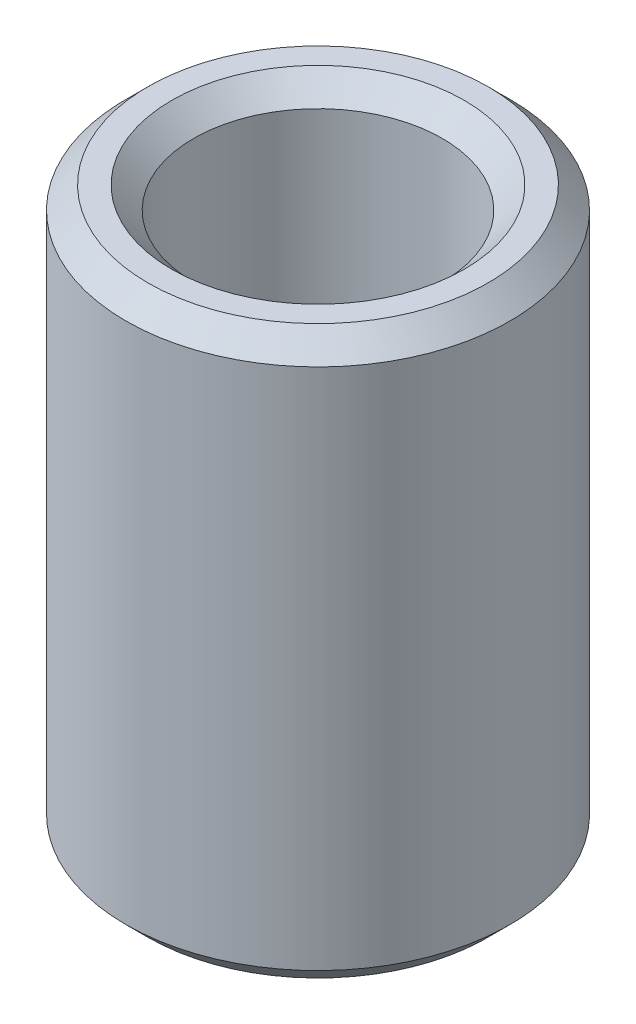
ISO-10303-21;
HEADER;
FILE_DESCRIPTION(('STEP AP214'),'2;1');
FILE_NAME('part.step','',(''),(''),'','','');
FILE_SCHEMA(('AUTOMOTIVE_DESIGN { 1 0 10303 214 1 1 1 1 }'));
ENDSEC;
DATA;
#1=APPLICATION_CONTEXT('core data for automotive mechanical design processes');
#2=APPLICATION_PROTOCOL_DEFINITION('international standard','automotive_design',2000,#1);
#3=PRODUCT_CONTEXT('',#1,'mechanical');
#4=PRODUCT('Part','Part','',(#3));
#5=PRODUCT_RELATED_PRODUCT_CATEGORY('part','',(#4));
#6=PRODUCT_DEFINITION_FORMATION('','',#4);
#7=PRODUCT_DEFINITION_CONTEXT('part definition',#1,'design');
#8=PRODUCT_DEFINITION('design','',#6,#7);
#9=PRODUCT_DEFINITION_SHAPE('','',#8);
#10=(LENGTH_UNIT() NAMED_UNIT(*) SI_UNIT(.MILLI.,.METRE.));
#11=(NAMED_UNIT(*) PLANE_ANGLE_UNIT() SI_UNIT($,.RADIAN.));
#12=(NAMED_UNIT(*) SI_UNIT($,.STERADIAN.) SOLID_ANGLE_UNIT());
#13=UNCERTAINTY_MEASURE_WITH_UNIT(LENGTH_MEASURE(1.E-05),#10,'distance_accuracy_value','');
#14=(GEOMETRIC_REPRESENTATION_CONTEXT(3) GLOBAL_UNCERTAINTY_ASSIGNED_CONTEXT((#13)) GLOBAL_UNIT_ASSIGNED_CONTEXT((#10,
#11,#12)) REPRESENTATION_CONTEXT('',''));
#15=CARTESIAN_POINT('',(0.,0.,0.));
#16=DIRECTION('',(0.,0.,1.));
#17=DIRECTION('',(1.,0.,0.));
#18=AXIS2_PLACEMENT_3D('',#15,#16,#17);
#19=CARTESIAN_POINT('',(0.,22.1363297240755,0.));
#20=DIRECTION('',(0.,-1.,0.));
#21=DIRECTION('',(0.,0.,-1.));
#22=AXIS2_PLACEMENT_3D('',#19,#20,#21);
#23=CYLINDRICAL_SURFACE('',#22,7.5);
#24=CARTESIAN_POINT('',(0.,0.85842697095161,0.));
#25=DIRECTION('',(0.,1.,0.));
#26=DIRECTION('',(0.,0.,1.));
#27=AXIS2_PLACEMENT_3D('',#24,#25,#26);
#28=CIRCLE('',#27,7.5);
#29=CARTESIAN_POINT('',(0.,0.85842697095161,7.5));
#30=VERTEX_POINT('',#29);
#31=EDGE_CURVE('E10',#30,#30,#28,.T.);
#32=ORIENTED_EDGE('',*,*,#31,.T.);
#33=EDGE_LOOP('',(#32));
#34=FACE_BOUND('',#33,.T.);
#35=CARTESIAN_POINT('',(0.,21.2779027531239,0.));
#36=DIRECTION('',(0.,1.,0.));
#37=DIRECTION('',(0.,0.,1.));
#38=AXIS2_PLACEMENT_3D('',#35,#36,#37);
#39=CIRCLE('',#38,7.5);
#40=CARTESIAN_POINT('',(0.,21.2779027531239,7.5));
#41=VERTEX_POINT('',#40);
#42=EDGE_CURVE('E50',#41,#41,#39,.F.);
#43=ORIENTED_EDGE('',*,*,#42,.T.);
#44=EDGE_LOOP('',(#43));
#45=FACE_BOUND('',#44,.T.);
#46=ADVANCED_FACE('F39',(#34,#45),#23,.T.);
#47=CARTESIAN_POINT('',(0.,22.1363297240755,0.));
#48=DIRECTION('',(0.,1.,0.));
#49=DIRECTION('',(0.,0.,1.));
#50=AXIS2_PLACEMENT_3D('',#47,#48,#49);
#51=PLANE('',#50);
#52=CARTESIAN_POINT('',(0.,22.1363297240755,0.));
#53=DIRECTION('',(0.,1.,0.));
#54=DIRECTION('',(0.,0.,1.));
#55=AXIS2_PLACEMENT_3D('',#52,#53,#54);
#56=CIRCLE('',#55,5.71524477503411);
#57=CARTESIAN_POINT('',(0.,22.1363297240755,5.71524477503411));
#58=VERTEX_POINT('',#57);
#59=EDGE_CURVE('E58',#58,#58,#56,.F.);
#60=ORIENTED_EDGE('',*,*,#59,.T.);
#61=EDGE_LOOP('',(#60));
#62=FACE_BOUND('',#61,.T.);
#63=CARTESIAN_POINT('',(0.,22.1363297240755,0.));
#64=DIRECTION('',(0.,1.,0.));
#65=DIRECTION('',(0.,0.,1.));
#66=AXIS2_PLACEMENT_3D('',#63,#64,#65);
#67=CIRCLE('',#66,6.64157302904839);
#68=CARTESIAN_POINT('',(0.,22.1363297240755,6.64157302904839));
#69=VERTEX_POINT('',#68);
#70=EDGE_CURVE('E61',#69,#69,#67,.T.);
#71=ORIENTED_EDGE('',*,*,#70,.T.);
#72=EDGE_LOOP('',(#71));
#73=FACE_BOUND('',#72,.T.);
#74=ADVANCED_FACE('F88',(#62,#73),#51,.T.);
#75=CARTESIAN_POINT('',(0.,0.,0.));
#76=DIRECTION('',(0.,1.,0.));
#77=DIRECTION('',(0.,0.,1.));
#78=AXIS2_PLACEMENT_3D('',#75,#76,#77);
#79=PLANE('',#78);
#80=CARTESIAN_POINT('',(0.,0.,0.));
#81=DIRECTION('',(0.,1.,0.));
#82=DIRECTION('',(0.,0.,1.));
#83=AXIS2_PLACEMENT_3D('',#80,#81,#82);
#84=CIRCLE('',#83,5.7152447750341);
#85=CARTESIAN_POINT('',(0.,0.,5.7152447750341));
#86=VERTEX_POINT('',#85);
#87=EDGE_CURVE('E51',#86,#86,#84,.T.);
#88=ORIENTED_EDGE('',*,*,#87,.T.);
#89=EDGE_LOOP('',(#88));
#90=FACE_BOUND('',#89,.T.);
#91=CARTESIAN_POINT('',(0.,0.,0.));
#92=DIRECTION('',(0.,1.,0.));
#93=DIRECTION('',(0.,0.,1.));
#94=AXIS2_PLACEMENT_3D('',#91,#92,#93);
#95=CIRCLE('',#94,6.64157302904839);
#96=CARTESIAN_POINT('',(0.,0.,6.64157302904839));
#97=VERTEX_POINT('',#96);
#98=EDGE_CURVE('E54',#97,#97,#95,.F.);
#99=ORIENTED_EDGE('',*,*,#98,.T.);
#100=EDGE_LOOP('',(#99));
#101=FACE_BOUND('',#100,.T.);
#102=ADVANCED_FACE('F83',(#90,#101),#79,.F.);
#103=CARTESIAN_POINT('',(0.,22.1363297240755,0.));
#104=DIRECTION('',(0.,-1.,0.));
#105=DIRECTION('',(0.,0.,-1.));
#106=AXIS2_PLACEMENT_3D('',#103,#104,#105);
#107=CYLINDRICAL_SURFACE('',#106,4.8568178040825);
#108=CARTESIAN_POINT('',(0.,21.2779027531239,0.));
#109=DIRECTION('',(0.,1.,0.));
#110=DIRECTION('',(0.,0.,1.));
#111=AXIS2_PLACEMENT_3D('',#108,#109,#110);
#112=CIRCLE('',#111,4.8568178040825);
#113=CARTESIAN_POINT('',(0.,21.2779027531239,4.8568178040825));
#114=VERTEX_POINT('',#113);
#115=EDGE_CURVE('E67',#114,#114,#112,.T.);
#116=ORIENTED_EDGE('',*,*,#115,.T.);
#117=EDGE_LOOP('',(#116));
#118=FACE_BOUND('',#117,.T.);
#119=CARTESIAN_POINT('',(0.,0.85842697095161,0.));
#120=DIRECTION('',(0.,1.,0.));
#121=DIRECTION('',(0.,0.,1.));
#122=AXIS2_PLACEMENT_3D('',#119,#120,#121);
#123=CIRCLE('',#122,4.8568178040825);
#124=CARTESIAN_POINT('',(0.,0.85842697095161,4.8568178040825));
#125=VERTEX_POINT('',#124);
#126=EDGE_CURVE('E69',#125,#125,#123,.F.);
#127=ORIENTED_EDGE('',*,*,#126,.T.);
#128=EDGE_LOOP('',(#127));
#129=FACE_BOUND('',#128,.T.);
#130=ADVANCED_FACE('F71',(#118,#129),#107,.F.);
#131=CARTESIAN_POINT('',(0.,21.2779027531239,0.));
#132=DIRECTION('',(0.,1.,0.));
#133=DIRECTION('',(0.,0.,1.));
#134=AXIS2_PLACEMENT_3D('',#131,#132,#133);
#135=CONICAL_SURFACE('',#134,4.8568178040825,0.785398163397453);
#136=ORIENTED_EDGE('',*,*,#59,.F.);
#137=EDGE_LOOP('',(#136));
#138=FACE_BOUND('',#137,.T.);
#139=ORIENTED_EDGE('',*,*,#115,.F.);
#140=EDGE_LOOP('',(#139));
#141=FACE_BOUND('',#140,.T.);
#142=ADVANCED_FACE('F77',(#138,#141),#135,.F.);
#143=CARTESIAN_POINT('',(0.,0.,0.));
#144=DIRECTION('',(0.,-1.,0.));
#145=DIRECTION('',(0.,0.,-1.));
#146=AXIS2_PLACEMENT_3D('',#143,#144,#145);
#147=CONICAL_SURFACE('',#146,5.7152447750341,0.785398163397447);
#148=ORIENTED_EDGE('',*,*,#126,.F.);
#149=EDGE_LOOP('',(#148));
#150=FACE_BOUND('',#149,.T.);
#151=ORIENTED_EDGE('',*,*,#87,.F.);
#152=EDGE_LOOP('',(#151));
#153=FACE_BOUND('',#152,.T.);
#154=ADVANCED_FACE('F73',(#150,#153),#147,.F.);
#155=CARTESIAN_POINT('',(0.,0.85842697095161,0.));
#156=DIRECTION('',(0.,1.,0.));
#157=DIRECTION('',(0.,0.,1.));
#158=AXIS2_PLACEMENT_3D('',#155,#156,#157);
#159=CONICAL_SURFACE('',#158,7.5,0.785398163397451);
#160=ORIENTED_EDGE('',*,*,#98,.F.);
#161=EDGE_LOOP('',(#160));
#162=FACE_BOUND('',#161,.T.);
#163=ORIENTED_EDGE('',*,*,#31,.F.);
#164=EDGE_LOOP('',(#163));
#165=FACE_BOUND('',#164,.T.);
#166=ADVANCED_FACE('F76',(#162,#165),#159,.T.);
#167=CARTESIAN_POINT('',(0.,22.1363297240755,0.));
#168=DIRECTION('',(0.,-1.,0.));
#169=DIRECTION('',(0.,0.,-1.));
#170=AXIS2_PLACEMENT_3D('',#167,#168,#169);
#171=CONICAL_SURFACE('',#170,6.64157302904839,0.785398163397446);
#172=ORIENTED_EDGE('',*,*,#42,.F.);
#173=EDGE_LOOP('',(#172));
#174=FACE_BOUND('',#173,.T.);
#175=ORIENTED_EDGE('',*,*,#70,.F.);
#176=EDGE_LOOP('',(#175));
#177=FACE_BOUND('',#176,.T.);
#178=ADVANCED_FACE('F45',(#174,#177),#171,.T.);
#179=CLOSED_SHELL('',(#46,#74,#102,#130,#142,#154,#166,#178));
#180=MANIFOLD_SOLID_BREP('B2',#179);
#181=ADVANCED_BREP_SHAPE_REPRESENTATION('',(#18,#180),#14);
#182=SHAPE_DEFINITION_REPRESENTATION(#9,#181);
ENDSEC;
END-ISO-10303-21;
